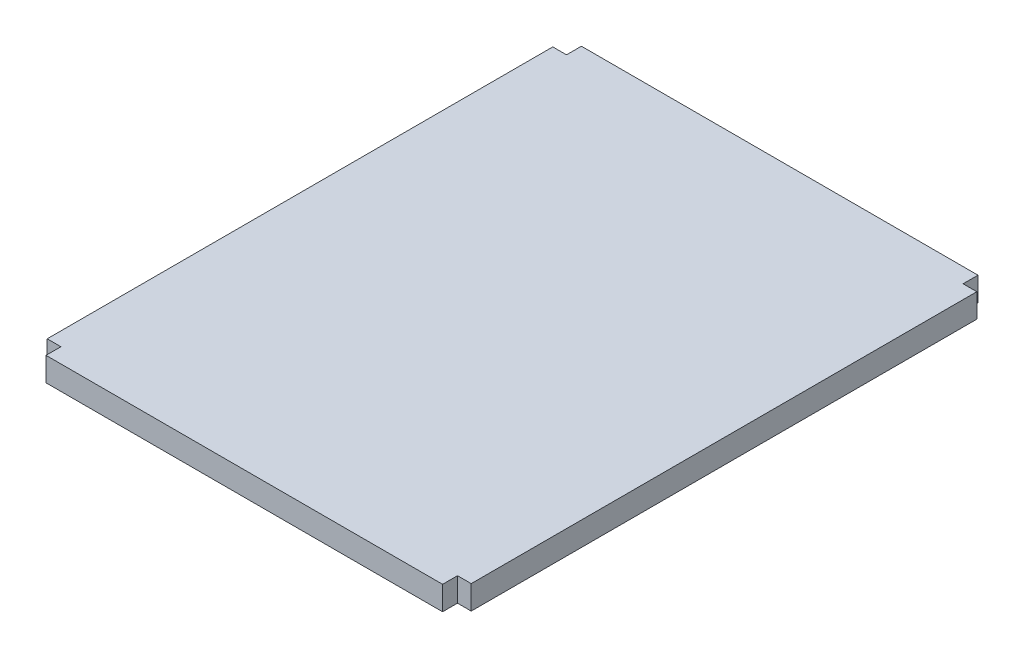
ISO-10303-21;
HEADER;
FILE_DESCRIPTION(('STEP AP214'),'2;1');
FILE_NAME('part.step','',(''),(''),'','','');
FILE_SCHEMA(('AUTOMOTIVE_DESIGN { 1 0 10303 214 1 1 1 1 }'));
ENDSEC;
DATA;
#1=APPLICATION_CONTEXT('core data for automotive mechanical design processes');
#2=APPLICATION_PROTOCOL_DEFINITION('international standard','automotive_design',2000,#1);
#3=PRODUCT_CONTEXT('',#1,'mechanical');
#4=PRODUCT('Part','Part','',(#3));
#5=PRODUCT_RELATED_PRODUCT_CATEGORY('part','',(#4));
#6=PRODUCT_DEFINITION_FORMATION('','',#4);
#7=PRODUCT_DEFINITION_CONTEXT('part definition',#1,'design');
#8=PRODUCT_DEFINITION('design','',#6,#7);
#9=PRODUCT_DEFINITION_SHAPE('','',#8);
#10=(LENGTH_UNIT() NAMED_UNIT(*) SI_UNIT(.MILLI.,.METRE.));
#11=(NAMED_UNIT(*) PLANE_ANGLE_UNIT() SI_UNIT($,.RADIAN.));
#12=(NAMED_UNIT(*) SI_UNIT($,.STERADIAN.) SOLID_ANGLE_UNIT());
#13=UNCERTAINTY_MEASURE_WITH_UNIT(LENGTH_MEASURE(1.E-05),#10,'distance_accuracy_value','');
#14=(GEOMETRIC_REPRESENTATION_CONTEXT(3) GLOBAL_UNCERTAINTY_ASSIGNED_CONTEXT((#13)) GLOBAL_UNIT_ASSIGNED_CONTEXT((#10,
#11,#12)) REPRESENTATION_CONTEXT('',''));
#15=CARTESIAN_POINT('',(0.,0.,0.));
#16=DIRECTION('',(0.,0.,1.));
#17=DIRECTION('',(1.,0.,0.));
#18=AXIS2_PLACEMENT_3D('',#15,#16,#17);
#19=CARTESIAN_POINT('',(-1057.148,127.,-1347.724));
#20=DIRECTION('',(1.,0.,0.));
#21=DIRECTION('',(0.,0.,-1.));
#22=AXIS2_PLACEMENT_3D('',#19,#20,#21);
#23=PLANE('',#22);
#24=DIRECTION('',(0.,0.,1.));
#25=VECTOR('',#24,1.);
#26=CARTESIAN_POINT('',(-1057.148,0.,-1347.724));
#27=LINE('',#26,#25);
#28=CARTESIAN_POINT('',(-1057.148,0.,-1427.226));
#29=VERTEX_POINT('',#28);
#30=CARTESIAN_POINT('',(-1057.148,0.,-1347.724));
#31=VERTEX_POINT('',#30);
#32=EDGE_CURVE('E155',#29,#31,#27,.T.);
#33=ORIENTED_EDGE('',*,*,#32,.T.);
#34=DIRECTION('',(0.,-1.,0.));
#35=VECTOR('',#34,1.);
#36=CARTESIAN_POINT('',(-1057.148,127.,-1347.724));
#37=LINE('',#36,#35);
#38=CARTESIAN_POINT('',(-1057.148,127.,-1347.724));
#39=VERTEX_POINT('',#38);
#40=EDGE_CURVE('E11',#39,#31,#37,.T.);
#41=ORIENTED_EDGE('',*,*,#40,.F.);
#42=DIRECTION('',(0.,0.,1.));
#43=VECTOR('',#42,1.);
#44=CARTESIAN_POINT('',(-1057.148,127.,-1347.724));
#45=LINE('',#44,#43);
#46=CARTESIAN_POINT('',(-1057.148,127.,-1427.226));
#47=VERTEX_POINT('',#46);
#48=EDGE_CURVE('E177',#47,#39,#45,.T.);
#49=ORIENTED_EDGE('',*,*,#48,.F.);
#50=DIRECTION('',(0.,-1.,0.));
#51=VECTOR('',#50,1.);
#52=CARTESIAN_POINT('',(-1057.148,127.,-1427.226));
#53=LINE('',#52,#51);
#54=EDGE_CURVE('E151',#47,#29,#53,.T.);
#55=ORIENTED_EDGE('',*,*,#54,.T.);
#56=EDGE_LOOP('',(#33,#41,#49,#55));
#57=FACE_BOUND('',#56,.T.);
#58=ADVANCED_FACE('F35',(#57),#23,.F.);
#59=CARTESIAN_POINT('',(-1057.148,127.,-1347.724));
#60=DIRECTION('',(0.,0.,1.));
#61=DIRECTION('',(1.,0.,0.));
#62=AXIS2_PLACEMENT_3D('',#59,#60,#61);
#63=PLANE('',#62);
#64=DIRECTION('',(-1.,0.,0.));
#65=VECTOR('',#64,1.);
#66=CARTESIAN_POINT('',(-1057.148,0.,-1347.724));
#67=LINE('',#66,#65);
#68=CARTESIAN_POINT('',(-1130.3,0.,-1347.724));
#69=VERTEX_POINT('',#68);
#70=EDGE_CURVE('E158',#31,#69,#67,.T.);
#71=ORIENTED_EDGE('',*,*,#70,.T.);
#72=DIRECTION('',(0.,-1.,0.));
#73=VECTOR('',#72,1.);
#74=CARTESIAN_POINT('',(-1130.3,127.,-1347.724));
#75=LINE('',#74,#73);
#76=CARTESIAN_POINT('',(-1130.3,127.,-1347.724));
#77=VERTEX_POINT('',#76);
#78=EDGE_CURVE('E43',#77,#69,#75,.T.);
#79=ORIENTED_EDGE('',*,*,#78,.F.);
#80=DIRECTION('',(-1.,0.,0.));
#81=VECTOR('',#80,1.);
#82=CARTESIAN_POINT('',(-1057.148,127.,-1347.724));
#83=LINE('',#82,#81);
#84=EDGE_CURVE('E106',#39,#77,#83,.T.);
#85=ORIENTED_EDGE('',*,*,#84,.F.);
#86=ORIENTED_EDGE('',*,*,#40,.T.);
#87=EDGE_LOOP('',(#71,#79,#85,#86));
#88=FACE_BOUND('',#87,.T.);
#89=ADVANCED_FACE('F255',(#88),#63,.F.);
#90=CARTESIAN_POINT('',(-1130.3,127.,1347.724));
#91=DIRECTION('',(1.,0.,0.));
#92=DIRECTION('',(0.,0.,-1.));
#93=AXIS2_PLACEMENT_3D('',#90,#91,#92);
#94=PLANE('',#93);
#95=DIRECTION('',(0.,0.,1.));
#96=VECTOR('',#95,1.);
#97=CARTESIAN_POINT('',(-1130.3,0.,1347.724));
#98=LINE('',#97,#96);
#99=CARTESIAN_POINT('',(-1130.3,0.,1347.724));
#100=VERTEX_POINT('',#99);
#101=EDGE_CURVE('E160',#69,#100,#98,.T.);
#102=ORIENTED_EDGE('',*,*,#101,.T.);
#103=DIRECTION('',(0.,-1.,0.));
#104=VECTOR('',#103,1.);
#105=CARTESIAN_POINT('',(-1130.3,127.,1347.724));
#106=LINE('',#105,#104);
#107=CARTESIAN_POINT('',(-1130.3,127.,1347.724));
#108=VERTEX_POINT('',#107);
#109=EDGE_CURVE('E196',#108,#100,#106,.T.);
#110=ORIENTED_EDGE('',*,*,#109,.F.);
#111=DIRECTION('',(0.,0.,1.));
#112=VECTOR('',#111,1.);
#113=CARTESIAN_POINT('',(-1130.3,127.,1347.724));
#114=LINE('',#113,#112);
#115=EDGE_CURVE('E204',#77,#108,#114,.T.);
#116=ORIENTED_EDGE('',*,*,#115,.F.);
#117=ORIENTED_EDGE('',*,*,#78,.T.);
#118=EDGE_LOOP('',(#102,#110,#116,#117));
#119=FACE_BOUND('',#118,.T.);
#120=ADVANCED_FACE('F202',(#119),#94,.F.);
#121=CARTESIAN_POINT('',(-1057.14799999997,127.,1347.724));
#122=DIRECTION('',(0.,0.,-1.));
#123=DIRECTION('',(-1.,0.,0.));
#124=AXIS2_PLACEMENT_3D('',#121,#122,#123);
#125=PLANE('',#124);
#126=DIRECTION('',(1.,0.,0.));
#127=VECTOR('',#126,1.);
#128=CARTESIAN_POINT('',(-1057.14799999997,0.,1347.724));
#129=LINE('',#128,#127);
#130=CARTESIAN_POINT('',(-1057.14799999997,0.,1347.724));
#131=VERTEX_POINT('',#130);
#132=EDGE_CURVE('E162',#100,#131,#129,.T.);
#133=ORIENTED_EDGE('',*,*,#132,.T.);
#134=DIRECTION('',(0.,-1.,0.));
#135=VECTOR('',#134,1.);
#136=CARTESIAN_POINT('',(-1057.14799999997,127.,1347.724));
#137=LINE('',#136,#135);
#138=CARTESIAN_POINT('',(-1057.14799999997,127.,1347.724));
#139=VERTEX_POINT('',#138);
#140=EDGE_CURVE('E193',#139,#131,#137,.T.);
#141=ORIENTED_EDGE('',*,*,#140,.F.);
#142=DIRECTION('',(1.,0.,0.));
#143=VECTOR('',#142,1.);
#144=CARTESIAN_POINT('',(-1057.14799999997,127.,1347.724));
#145=LINE('',#144,#143);
#146=EDGE_CURVE('E222',#108,#139,#145,.T.);
#147=ORIENTED_EDGE('',*,*,#146,.F.);
#148=ORIENTED_EDGE('',*,*,#109,.T.);
#149=EDGE_LOOP('',(#133,#141,#147,#148));
#150=FACE_BOUND('',#149,.T.);
#151=ADVANCED_FACE('F213',(#150),#125,.F.);
#152=CARTESIAN_POINT('',(-1057.14799999997,127.,1427.226));
#153=DIRECTION('',(1.,0.,0.));
#154=DIRECTION('',(0.,0.,-1.));
#155=AXIS2_PLACEMENT_3D('',#152,#153,#154);
#156=PLANE('',#155);
#157=DIRECTION('',(0.,0.,1.));
#158=VECTOR('',#157,1.);
#159=CARTESIAN_POINT('',(-1057.14799999997,0.,1427.226));
#160=LINE('',#159,#158);
#161=CARTESIAN_POINT('',(-1057.14799999997,0.,1427.226));
#162=VERTEX_POINT('',#161);
#163=EDGE_CURVE('E164',#131,#162,#160,.T.);
#164=ORIENTED_EDGE('',*,*,#163,.T.);
#165=DIRECTION('',(0.,-1.,0.));
#166=VECTOR('',#165,1.);
#167=CARTESIAN_POINT('',(-1057.14799999997,127.,1427.226));
#168=LINE('',#167,#166);
#169=CARTESIAN_POINT('',(-1057.14799999997,127.,1427.226));
#170=VERTEX_POINT('',#169);
#171=EDGE_CURVE('E190',#170,#162,#168,.T.);
#172=ORIENTED_EDGE('',*,*,#171,.F.);
#173=DIRECTION('',(0.,0.,1.));
#174=VECTOR('',#173,1.);
#175=CARTESIAN_POINT('',(-1057.14799999997,127.,1427.226));
#176=LINE('',#175,#174);
#177=EDGE_CURVE('E219',#139,#170,#176,.T.);
#178=ORIENTED_EDGE('',*,*,#177,.F.);
#179=ORIENTED_EDGE('',*,*,#140,.T.);
#180=EDGE_LOOP('',(#164,#172,#178,#179));
#181=FACE_BOUND('',#180,.T.);
#182=ADVANCED_FACE('F217',(#181),#156,.F.);
#183=CARTESIAN_POINT('',(-1057.14799999997,127.,1427.226));
#184=DIRECTION('',(0.,0.,-1.));
#185=DIRECTION('',(-1.,0.,0.));
#186=AXIS2_PLACEMENT_3D('',#183,#184,#185);
#187=PLANE('',#186);
#188=DIRECTION('',(1.,0.,0.));
#189=VECTOR('',#188,1.);
#190=CARTESIAN_POINT('',(-1057.14799999997,0.,1427.226));
#191=LINE('',#190,#189);
#192=CARTESIAN_POINT('',(1057.14799999994,0.,1427.226));
#193=VERTEX_POINT('',#192);
#194=EDGE_CURVE('E166',#162,#193,#191,.T.);
#195=ORIENTED_EDGE('',*,*,#194,.T.);
#196=DIRECTION('',(0.,-1.,0.));
#197=VECTOR('',#196,1.);
#198=CARTESIAN_POINT('',(1057.14799999994,127.,1427.226));
#199=LINE('',#198,#197);
#200=CARTESIAN_POINT('',(1057.14799999994,127.,1427.226));
#201=VERTEX_POINT('',#200);
#202=EDGE_CURVE('E187',#201,#193,#199,.T.);
#203=ORIENTED_EDGE('',*,*,#202,.F.);
#204=DIRECTION('',(1.,0.,0.));
#205=VECTOR('',#204,1.);
#206=CARTESIAN_POINT('',(-1057.14799999997,127.,1427.226));
#207=LINE('',#206,#205);
#208=EDGE_CURVE('E221',#170,#201,#207,.T.);
#209=ORIENTED_EDGE('',*,*,#208,.F.);
#210=ORIENTED_EDGE('',*,*,#171,.T.);
#211=EDGE_LOOP('',(#195,#203,#209,#210));
#212=FACE_BOUND('',#211,.T.);
#213=ADVANCED_FACE('F268',(#212),#187,.F.);
#214=CARTESIAN_POINT('',(1057.14799999994,127.,1427.226));
#215=DIRECTION('',(-1.,0.,0.));
#216=DIRECTION('',(0.,0.,1.));
#217=AXIS2_PLACEMENT_3D('',#214,#215,#216);
#218=PLANE('',#217);
#219=DIRECTION('',(0.,0.,-1.));
#220=VECTOR('',#219,1.);
#221=CARTESIAN_POINT('',(1057.14799999994,0.,1427.226));
#222=LINE('',#221,#220);
#223=CARTESIAN_POINT('',(1057.14799999995,0.,1347.724));
#224=VERTEX_POINT('',#223);
#225=EDGE_CURVE('E168',#193,#224,#222,.T.);
#226=ORIENTED_EDGE('',*,*,#225,.T.);
#227=DIRECTION('',(0.,-1.,0.));
#228=VECTOR('',#227,1.);
#229=CARTESIAN_POINT('',(1057.14799999995,127.,1347.724));
#230=LINE('',#229,#228);
#231=CARTESIAN_POINT('',(1057.14799999995,127.,1347.724));
#232=VERTEX_POINT('',#231);
#233=EDGE_CURVE('E184',#232,#224,#230,.T.);
#234=ORIENTED_EDGE('',*,*,#233,.F.);
#235=DIRECTION('',(0.,0.,-1.));
#236=VECTOR('',#235,1.);
#237=CARTESIAN_POINT('',(1057.14799999994,127.,1427.226));
#238=LINE('',#237,#236);
#239=EDGE_CURVE('E224',#201,#232,#238,.T.);
#240=ORIENTED_EDGE('',*,*,#239,.F.);
#241=ORIENTED_EDGE('',*,*,#202,.T.);
#242=EDGE_LOOP('',(#226,#234,#240,#241));
#243=FACE_BOUND('',#242,.T.);
#244=ADVANCED_FACE('F271',(#243),#218,.F.);
#245=CARTESIAN_POINT('',(1130.30000000003,127.,1347.724));
#246=DIRECTION('',(0.,0.,-1.));
#247=DIRECTION('',(-1.,0.,0.));
#248=AXIS2_PLACEMENT_3D('',#245,#246,#247);
#249=PLANE('',#248);
#250=DIRECTION('',(1.,0.,0.));
#251=VECTOR('',#250,1.);
#252=CARTESIAN_POINT('',(1130.30000000003,0.,1347.724));
#253=LINE('',#252,#251);
#254=CARTESIAN_POINT('',(1130.30000000003,0.,1347.724));
#255=VERTEX_POINT('',#254);
#256=EDGE_CURVE('E170',#224,#255,#253,.T.);
#257=ORIENTED_EDGE('',*,*,#256,.T.);
#258=DIRECTION('',(0.,-1.,0.));
#259=VECTOR('',#258,1.);
#260=CARTESIAN_POINT('',(1130.30000000003,127.,1347.724));
#261=LINE('',#260,#259);
#262=CARTESIAN_POINT('',(1130.30000000003,127.,1347.724));
#263=VERTEX_POINT('',#262);
#264=EDGE_CURVE('E181',#263,#255,#261,.T.);
#265=ORIENTED_EDGE('',*,*,#264,.F.);
#266=DIRECTION('',(1.,0.,0.));
#267=VECTOR('',#266,1.);
#268=CARTESIAN_POINT('',(1130.30000000003,127.,1347.724));
#269=LINE('',#268,#267);
#270=EDGE_CURVE('E230',#232,#263,#269,.T.);
#271=ORIENTED_EDGE('',*,*,#270,.F.);
#272=ORIENTED_EDGE('',*,*,#233,.T.);
#273=EDGE_LOOP('',(#257,#265,#271,#272));
#274=FACE_BOUND('',#273,.T.);
#275=ADVANCED_FACE('F236',(#274),#249,.F.);
#276=CARTESIAN_POINT('',(1130.30000000003,127.,1347.724));
#277=DIRECTION('',(-1.,0.,0.));
#278=DIRECTION('',(0.,0.,1.));
#279=AXIS2_PLACEMENT_3D('',#276,#277,#278);
#280=PLANE('',#279);
#281=DIRECTION('',(0.,0.,-1.));
#282=VECTOR('',#281,1.);
#283=CARTESIAN_POINT('',(1130.30000000003,0.,1347.724));
#284=LINE('',#283,#282);
#285=CARTESIAN_POINT('',(1130.3,0.,-1347.724));
#286=VERTEX_POINT('',#285);
#287=EDGE_CURVE('E172',#255,#286,#284,.T.);
#288=ORIENTED_EDGE('',*,*,#287,.T.);
#289=DIRECTION('',(0.,-1.,0.));
#290=VECTOR('',#289,1.);
#291=CARTESIAN_POINT('',(1130.3,127.,-1347.724));
#292=LINE('',#291,#290);
#293=CARTESIAN_POINT('',(1130.3,127.,-1347.724));
#294=VERTEX_POINT('',#293);
#295=EDGE_CURVE('E146',#294,#286,#292,.T.);
#296=ORIENTED_EDGE('',*,*,#295,.F.);
#297=DIRECTION('',(0.,0.,-1.));
#298=VECTOR('',#297,1.);
#299=CARTESIAN_POINT('',(1130.30000000003,127.,1347.724));
#300=LINE('',#299,#298);
#301=EDGE_CURVE('E137',#263,#294,#300,.T.);
#302=ORIENTED_EDGE('',*,*,#301,.F.);
#303=ORIENTED_EDGE('',*,*,#264,.T.);
#304=EDGE_LOOP('',(#288,#296,#302,#303));
#305=FACE_BOUND('',#304,.T.);
#306=ADVANCED_FACE('F240',(#305),#280,.F.);
#307=CARTESIAN_POINT('',(1130.3,127.,-1347.724));
#308=DIRECTION('',(0.,0.,1.));
#309=DIRECTION('',(1.,0.,0.));
#310=AXIS2_PLACEMENT_3D('',#307,#308,#309);
#311=PLANE('',#310);
#312=DIRECTION('',(-1.,0.,0.));
#313=VECTOR('',#312,1.);
#314=CARTESIAN_POINT('',(1130.3,0.,-1347.724));
#315=LINE('',#314,#313);
#316=CARTESIAN_POINT('',(1057.148,0.,-1347.724));
#317=VERTEX_POINT('',#316);
#318=EDGE_CURVE('E145',#286,#317,#315,.T.);
#319=ORIENTED_EDGE('',*,*,#318,.T.);
#320=DIRECTION('',(0.,-1.,0.));
#321=VECTOR('',#320,1.);
#322=CARTESIAN_POINT('',(1057.148,127.,-1347.724));
#323=LINE('',#322,#321);
#324=CARTESIAN_POINT('',(1057.148,127.,-1347.724));
#325=VERTEX_POINT('',#324);
#326=EDGE_CURVE('E142',#325,#317,#323,.T.);
#327=ORIENTED_EDGE('',*,*,#326,.F.);
#328=DIRECTION('',(-1.,0.,0.));
#329=VECTOR('',#328,1.);
#330=CARTESIAN_POINT('',(1130.3,127.,-1347.724));
#331=LINE('',#330,#329);
#332=EDGE_CURVE('E131',#294,#325,#331,.T.);
#333=ORIENTED_EDGE('',*,*,#332,.F.);
#334=ORIENTED_EDGE('',*,*,#295,.T.);
#335=EDGE_LOOP('',(#319,#327,#333,#334));
#336=FACE_BOUND('',#335,.T.);
#337=ADVANCED_FACE('F143',(#336),#311,.F.);
#338=CARTESIAN_POINT('',(1057.148,127.,-1347.724));
#339=DIRECTION('',(-1.,0.,0.));
#340=DIRECTION('',(0.,0.,1.));
#341=AXIS2_PLACEMENT_3D('',#338,#339,#340);
#342=PLANE('',#341);
#343=DIRECTION('',(0.,0.,-1.));
#344=VECTOR('',#343,1.);
#345=CARTESIAN_POINT('',(1057.148,0.,-1347.724));
#346=LINE('',#345,#344);
#347=CARTESIAN_POINT('',(1057.148,0.,-1427.226));
#348=VERTEX_POINT('',#347);
#349=EDGE_CURVE('E92',#317,#348,#346,.T.);
#350=ORIENTED_EDGE('',*,*,#349,.T.);
#351=DIRECTION('',(0.,-1.,0.));
#352=VECTOR('',#351,1.);
#353=CARTESIAN_POINT('',(1057.148,127.,-1427.226));
#354=LINE('',#353,#352);
#355=CARTESIAN_POINT('',(1057.148,127.,-1427.226));
#356=VERTEX_POINT('',#355);
#357=EDGE_CURVE('E147',#356,#348,#354,.T.);
#358=ORIENTED_EDGE('',*,*,#357,.F.);
#359=DIRECTION('',(0.,0.,-1.));
#360=VECTOR('',#359,1.);
#361=CARTESIAN_POINT('',(1057.148,127.,-1347.724));
#362=LINE('',#361,#360);
#363=EDGE_CURVE('E135',#325,#356,#362,.T.);
#364=ORIENTED_EDGE('',*,*,#363,.F.);
#365=ORIENTED_EDGE('',*,*,#326,.T.);
#366=EDGE_LOOP('',(#350,#358,#364,#365));
#367=FACE_BOUND('',#366,.T.);
#368=ADVANCED_FACE('F149',(#367),#342,.F.);
#369=CARTESIAN_POINT('',(-1057.148,127.,-1427.226));
#370=DIRECTION('',(0.,0.,1.));
#371=DIRECTION('',(1.,0.,0.));
#372=AXIS2_PLACEMENT_3D('',#369,#370,#371);
#373=PLANE('',#372);
#374=DIRECTION('',(-1.,0.,0.));
#375=VECTOR('',#374,1.);
#376=CARTESIAN_POINT('',(-1057.148,0.,-1427.226));
#377=LINE('',#376,#375);
#378=EDGE_CURVE('E98',#348,#29,#377,.T.);
#379=ORIENTED_EDGE('',*,*,#378,.T.);
#380=ORIENTED_EDGE('',*,*,#54,.F.);
#381=DIRECTION('',(-1.,0.,0.));
#382=VECTOR('',#381,1.);
#383=CARTESIAN_POINT('',(-1057.148,127.,-1427.226));
#384=LINE('',#383,#382);
#385=EDGE_CURVE('E51',#356,#47,#384,.T.);
#386=ORIENTED_EDGE('',*,*,#385,.F.);
#387=ORIENTED_EDGE('',*,*,#357,.T.);
#388=EDGE_LOOP('',(#379,#380,#386,#387));
#389=FACE_BOUND('',#388,.T.);
#390=ADVANCED_FACE('F244',(#389),#373,.F.);
#391=CARTESIAN_POINT('',(0.,127.,0.));
#392=DIRECTION('',(0.,-1.,0.));
#393=DIRECTION('',(0.,0.,-1.));
#394=AXIS2_PLACEMENT_3D('',#391,#392,#393);
#395=PLANE('',#394);
#396=ORIENTED_EDGE('',*,*,#48,.T.);
#397=ORIENTED_EDGE('',*,*,#84,.T.);
#398=ORIENTED_EDGE('',*,*,#115,.T.);
#399=ORIENTED_EDGE('',*,*,#146,.T.);
#400=ORIENTED_EDGE('',*,*,#177,.T.);
#401=ORIENTED_EDGE('',*,*,#208,.T.);
#402=ORIENTED_EDGE('',*,*,#239,.T.);
#403=ORIENTED_EDGE('',*,*,#270,.T.);
#404=ORIENTED_EDGE('',*,*,#301,.T.);
#405=ORIENTED_EDGE('',*,*,#332,.T.);
#406=ORIENTED_EDGE('',*,*,#363,.T.);
#407=ORIENTED_EDGE('',*,*,#385,.T.);
#408=EDGE_LOOP('',(#396,#397,#398,#399,#400,#401,#402,#403,#404,#405,#406,#407));
#409=FACE_BOUND('',#408,.T.);
#410=ADVANCED_FACE('F133',(#409),#395,.F.);
#411=CARTESIAN_POINT('',(0.,0.,0.));
#412=DIRECTION('',(0.,-1.,0.));
#413=DIRECTION('',(0.,0.,-1.));
#414=AXIS2_PLACEMENT_3D('',#411,#412,#413);
#415=PLANE('',#414);
#416=ORIENTED_EDGE('',*,*,#32,.F.);
#417=ORIENTED_EDGE('',*,*,#378,.F.);
#418=ORIENTED_EDGE('',*,*,#349,.F.);
#419=ORIENTED_EDGE('',*,*,#318,.F.);
#420=ORIENTED_EDGE('',*,*,#287,.F.);
#421=ORIENTED_EDGE('',*,*,#256,.F.);
#422=ORIENTED_EDGE('',*,*,#225,.F.);
#423=ORIENTED_EDGE('',*,*,#194,.F.);
#424=ORIENTED_EDGE('',*,*,#163,.F.);
#425=ORIENTED_EDGE('',*,*,#132,.F.);
#426=ORIENTED_EDGE('',*,*,#101,.F.);
#427=ORIENTED_EDGE('',*,*,#70,.F.);
#428=EDGE_LOOP('',(#416,#417,#418,#419,#420,#421,#422,#423,#424,#425,#426,#427));
#429=FACE_BOUND('',#428,.T.);
#430=ADVANCED_FACE('F208',(#429),#415,.T.);
#431=CLOSED_SHELL('',(#58,#89,#120,#151,#182,#213,#244,#275,#306,#337,#368,#390,#410,#430));
#432=MANIFOLD_SOLID_BREP('B2',#431);
#433=ADVANCED_BREP_SHAPE_REPRESENTATION('',(#18,#432),#14);
#434=SHAPE_DEFINITION_REPRESENTATION(#9,#433);
ENDSEC;
END-ISO-10303-21;
